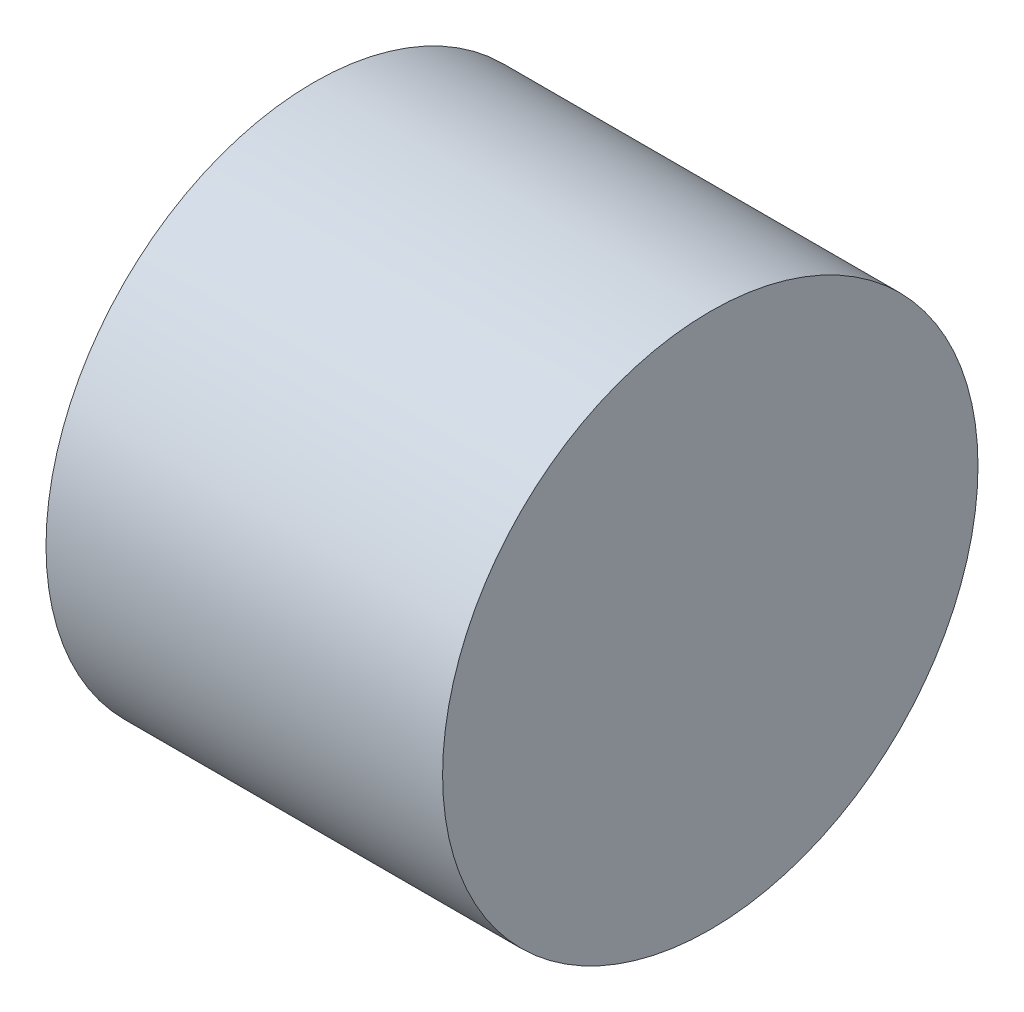
ISO-10303-21;
HEADER;
FILE_DESCRIPTION(('STEP AP214'),'2;1');
FILE_NAME('part.step','',(''),(''),'','','');
FILE_SCHEMA(('AUTOMOTIVE_DESIGN { 1 0 10303 214 1 1 1 1 }'));
ENDSEC;
DATA;
#1=APPLICATION_CONTEXT('core data for automotive mechanical design processes');
#2=APPLICATION_PROTOCOL_DEFINITION('international standard','automotive_design',2000,#1);
#3=PRODUCT_CONTEXT('',#1,'mechanical');
#4=PRODUCT('Part','Part','',(#3));
#5=PRODUCT_RELATED_PRODUCT_CATEGORY('part','',(#4));
#6=PRODUCT_DEFINITION_FORMATION('','',#4);
#7=PRODUCT_DEFINITION_CONTEXT('part definition',#1,'design');
#8=PRODUCT_DEFINITION('design','',#6,#7);
#9=PRODUCT_DEFINITION_SHAPE('','',#8);
#10=(LENGTH_UNIT() NAMED_UNIT(*) SI_UNIT(.MILLI.,.METRE.));
#11=(NAMED_UNIT(*) PLANE_ANGLE_UNIT() SI_UNIT($,.RADIAN.));
#12=(NAMED_UNIT(*) SI_UNIT($,.STERADIAN.) SOLID_ANGLE_UNIT());
#13=UNCERTAINTY_MEASURE_WITH_UNIT(LENGTH_MEASURE(1.E-05),#10,'distance_accuracy_value','');
#14=(GEOMETRIC_REPRESENTATION_CONTEXT(3) GLOBAL_UNCERTAINTY_ASSIGNED_CONTEXT((#13)) GLOBAL_UNIT_ASSIGNED_CONTEXT((#10,
#11,#12)) REPRESENTATION_CONTEXT('',''));
#15=CARTESIAN_POINT('',(0.,0.,0.));
#16=DIRECTION('',(0.,0.,1.));
#17=DIRECTION('',(1.,0.,0.));
#18=AXIS2_PLACEMENT_3D('',#15,#16,#17);
#19=CARTESIAN_POINT('',(20.,0.,0.));
#20=DIRECTION('',(-1.,0.,0.));
#21=DIRECTION('',(0.,0.,1.));
#22=AXIS2_PLACEMENT_3D('',#19,#20,#21);
#23=CYLINDRICAL_SURFACE('',#22,13.5);
#24=CARTESIAN_POINT('',(20.,0.,0.));
#25=DIRECTION('',(1.,0.,0.));
#26=DIRECTION('',(0.,0.,-1.));
#27=AXIS2_PLACEMENT_3D('',#24,#25,#26);
#28=CIRCLE('',#27,13.5);
#29=CARTESIAN_POINT('',(20.,0.,-13.5));
#30=VERTEX_POINT('',#29);
#31=EDGE_CURVE('E10',#30,#30,#28,.T.);
#32=ORIENTED_EDGE('',*,*,#31,.F.);
#33=EDGE_LOOP('',(#32));
#34=FACE_BOUND('',#33,.T.);
#35=CARTESIAN_POINT('',(0.,0.,0.));
#36=DIRECTION('',(1.,0.,0.));
#37=DIRECTION('',(0.,0.,-1.));
#38=AXIS2_PLACEMENT_3D('',#35,#36,#37);
#39=CIRCLE('',#38,13.5);
#40=CARTESIAN_POINT('',(0.,0.,-13.5));
#41=VERTEX_POINT('',#40);
#42=EDGE_CURVE('E37',#41,#41,#39,.T.);
#43=ORIENTED_EDGE('',*,*,#42,.T.);
#44=EDGE_LOOP('',(#43));
#45=FACE_BOUND('',#44,.T.);
#46=ADVANCED_FACE('F34',(#34,#45),#23,.T.);
#47=CARTESIAN_POINT('',(20.,0.,0.));
#48=DIRECTION('',(1.,0.,0.));
#49=DIRECTION('',(0.,0.,-1.));
#50=AXIS2_PLACEMENT_3D('',#47,#48,#49);
#51=PLANE('',#50);
#52=ORIENTED_EDGE('',*,*,#31,.T.);
#53=EDGE_LOOP('',(#52));
#54=FACE_BOUND('',#53,.T.);
#55=ADVANCED_FACE('F49',(#54),#51,.T.);
#56=CARTESIAN_POINT('',(0.,0.,0.));
#57=DIRECTION('',(1.,0.,0.));
#58=DIRECTION('',(0.,0.,-1.));
#59=AXIS2_PLACEMENT_3D('',#56,#57,#58);
#60=PLANE('',#59);
#61=ORIENTED_EDGE('',*,*,#42,.F.);
#62=EDGE_LOOP('',(#61));
#63=FACE_BOUND('',#62,.T.);
#64=ADVANCED_FACE('F47',(#63),#60,.F.);
#65=CLOSED_SHELL('',(#46,#55,#64));
#66=MANIFOLD_SOLID_BREP('B2',#65);
#67=ADVANCED_BREP_SHAPE_REPRESENTATION('',(#18,#66),#14);
#68=SHAPE_DEFINITION_REPRESENTATION(#9,#67);
ENDSEC;
END-ISO-10303-21;
